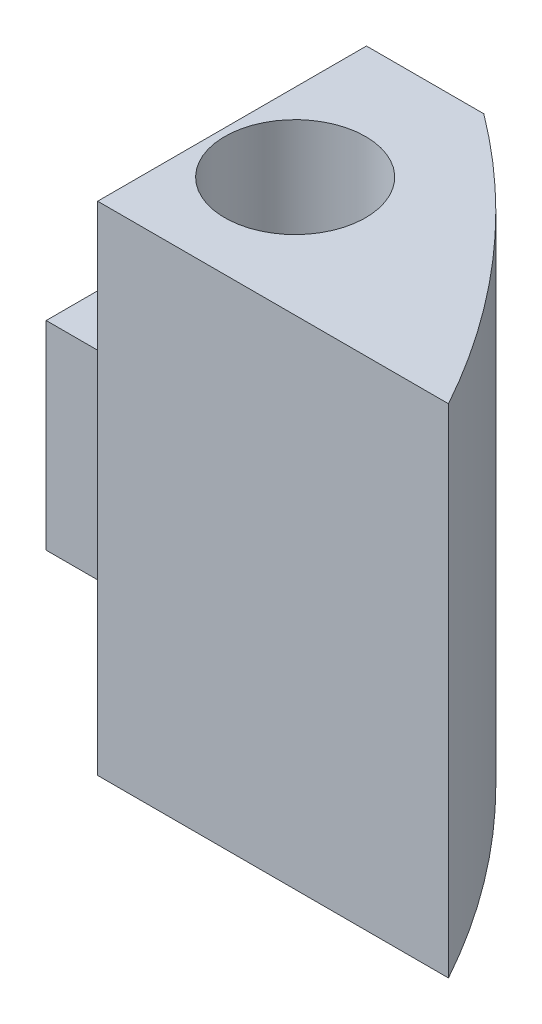
ISO-10303-21;
HEADER;
FILE_DESCRIPTION(('STEP AP214'),'2;1');
FILE_NAME('part.step','',(''),(''),'','','');
FILE_SCHEMA(('AUTOMOTIVE_DESIGN { 1 0 10303 214 1 1 1 1 }'));
ENDSEC;
DATA;
#1=APPLICATION_CONTEXT('core data for automotive mechanical design processes');
#2=APPLICATION_PROTOCOL_DEFINITION('international standard','automotive_design',2000,#1);
#3=PRODUCT_CONTEXT('',#1,'mechanical');
#4=PRODUCT('Part','Part','',(#3));
#5=PRODUCT_RELATED_PRODUCT_CATEGORY('part','',(#4));
#6=PRODUCT_DEFINITION_FORMATION('','',#4);
#7=PRODUCT_DEFINITION_CONTEXT('part definition',#1,'design');
#8=PRODUCT_DEFINITION('design','',#6,#7);
#9=PRODUCT_DEFINITION_SHAPE('','',#8);
#10=(LENGTH_UNIT() NAMED_UNIT(*) SI_UNIT(.MILLI.,.METRE.));
#11=(NAMED_UNIT(*) PLANE_ANGLE_UNIT() SI_UNIT($,.RADIAN.));
#12=(NAMED_UNIT(*) SI_UNIT($,.STERADIAN.) SOLID_ANGLE_UNIT());
#13=UNCERTAINTY_MEASURE_WITH_UNIT(LENGTH_MEASURE(1.E-05),#10,'distance_accuracy_value','');
#14=(GEOMETRIC_REPRESENTATION_CONTEXT(3) GLOBAL_UNCERTAINTY_ASSIGNED_CONTEXT((#13)) GLOBAL_UNIT_ASSIGNED_CONTEXT((#10,
#11,#12)) REPRESENTATION_CONTEXT('',''));
#15=CARTESIAN_POINT('',(0.,0.,0.));
#16=DIRECTION('',(0.,0.,1.));
#17=DIRECTION('',(1.,0.,0.));
#18=AXIS2_PLACEMENT_3D('',#15,#16,#17);
#19=CARTESIAN_POINT('',(12.446,69.6703463550339,-13.0097537928279));
#20=DIRECTION('',(1.,0.,0.));
#21=DIRECTION('',(0.,0.,-1.));
#22=AXIS2_PLACEMENT_3D('',#19,#20,#21);
#23=PLANE('',#22);
#24=DIRECTION('',(0.,-1.,0.));
#25=VECTOR('',#24,1.);
#26=CARTESIAN_POINT('',(12.446,69.6703463550339,-13.0097537928279));
#27=LINE('',#26,#25);
#28=CARTESIAN_POINT('',(12.446,55.5625,-13.0097537928279));
#29=VERTEX_POINT('',#28);
#30=CARTESIAN_POINT('',(12.446,39.6875,-13.0097537928279));
#31=VERTEX_POINT('',#30);
#32=EDGE_CURVE('E133',#29,#31,#27,.T.);
#33=ORIENTED_EDGE('',*,*,#32,.F.);
#34=DIRECTION('',(0.,0.,-1.));
#35=VECTOR('',#34,1.);
#36=CARTESIAN_POINT('',(12.446,55.5625,-13.0097537928279));
#37=LINE('',#36,#35);
#38=CARTESIAN_POINT('',(12.446,55.5625,-21.59));
#39=VERTEX_POINT('',#38);
#40=EDGE_CURVE('E142',#29,#39,#37,.T.);
#41=ORIENTED_EDGE('',*,*,#40,.T.);
#42=DIRECTION('',(0.,-1.,0.));
#43=VECTOR('',#42,1.);
#44=CARTESIAN_POINT('',(12.446,69.6703463550339,-21.59));
#45=LINE('',#44,#43);
#46=CARTESIAN_POINT('',(12.446,39.6875,-21.59));
#47=VERTEX_POINT('',#46);
#48=EDGE_CURVE('E138',#39,#47,#45,.T.);
#49=ORIENTED_EDGE('',*,*,#48,.T.);
#50=DIRECTION('',(0.,0.,1.));
#51=VECTOR('',#50,1.);
#52=CARTESIAN_POINT('',(12.446,39.6875,-13.0097537928279));
#53=LINE('',#52,#51);
#54=EDGE_CURVE('E134',#47,#31,#53,.T.);
#55=ORIENTED_EDGE('',*,*,#54,.T.);
#56=EDGE_LOOP('',(#33,#41,#49,#55));
#57=FACE_BOUND('',#56,.T.);
#58=DIRECTION('',(0.,1.,0.));
#59=VECTOR('',#58,1.);
#60=CARTESIAN_POINT('',(12.446,44.45,-13.6525));
#61=LINE('',#60,#59);
#62=CARTESIAN_POINT('',(12.446,44.45,-13.6525));
#63=VERTEX_POINT('',#62);
#64=CARTESIAN_POINT('',(12.446,50.8,-13.6525));
#65=VERTEX_POINT('',#64);
#66=EDGE_CURVE('E52',#63,#65,#61,.T.);
#67=ORIENTED_EDGE('',*,*,#66,.F.);
#68=DIRECTION('',(0.,0.,1.));
#69=VECTOR('',#68,1.);
#70=CARTESIAN_POINT('',(12.446,44.45,-20.0025));
#71=LINE('',#70,#69);
#72=CARTESIAN_POINT('',(12.446,44.45,-20.0025));
#73=VERTEX_POINT('',#72);
#74=EDGE_CURVE('E57',#73,#63,#71,.T.);
#75=ORIENTED_EDGE('',*,*,#74,.F.);
#76=DIRECTION('',(0.,-1.,0.));
#77=VECTOR('',#76,1.);
#78=CARTESIAN_POINT('',(12.446,50.8,-20.0025));
#79=LINE('',#78,#77);
#80=CARTESIAN_POINT('',(12.446,50.8,-20.0025));
#81=VERTEX_POINT('',#80);
#82=EDGE_CURVE('E99',#81,#73,#79,.T.);
#83=ORIENTED_EDGE('',*,*,#82,.F.);
#84=DIRECTION('',(0.,0.,-1.));
#85=VECTOR('',#84,1.);
#86=CARTESIAN_POINT('',(12.446,50.8,-13.6525));
#87=LINE('',#86,#85);
#88=EDGE_CURVE('E102',#65,#81,#87,.T.);
#89=ORIENTED_EDGE('',*,*,#88,.F.);
#90=EDGE_LOOP('',(#67,#75,#83,#89));
#91=FACE_BOUND('',#90,.T.);
#92=ADVANCED_FACE('F37',(#57,#91),#23,.F.);
#93=CARTESIAN_POINT('',(0.,39.6875,0.));
#94=DIRECTION('',(0.,1.,0.));
#95=DIRECTION('',(0.,0.,1.));
#96=AXIS2_PLACEMENT_3D('',#93,#94,#95);
#97=PLANE('',#96);
#98=CARTESIAN_POINT('',(0.,39.6875,0.));
#99=DIRECTION('',(0.,1.,0.));
#100=DIRECTION('',(0.,0.,1.));
#101=AXIS2_PLACEMENT_3D('',#98,#99,#100);
#102=CIRCLE('',#101,26.9875);
#103=CARTESIAN_POINT('',(23.6446920576268,39.6875,-13.0097537928279));
#104=VERTEX_POINT('',#103);
#105=CARTESIAN_POINT('',(16.1925,39.6875,-21.59));
#106=VERTEX_POINT('',#105);
#107=EDGE_CURVE('E144',#104,#106,#102,.T.);
#108=ORIENTED_EDGE('',*,*,#107,.F.);
#109=DIRECTION('',(1.,0.,0.));
#110=VECTOR('',#109,1.);
#111=CARTESIAN_POINT('',(12.446,39.6875,-13.0097537928279));
#112=LINE('',#111,#110);
#113=EDGE_CURVE('E45',#31,#104,#112,.T.);
#114=ORIENTED_EDGE('',*,*,#113,.F.);
#115=ORIENTED_EDGE('',*,*,#54,.F.);
#116=DIRECTION('',(-1.,0.,0.));
#117=VECTOR('',#116,1.);
#118=CARTESIAN_POINT('',(16.1925,39.6875,-21.59));
#119=LINE('',#118,#117);
#120=EDGE_CURVE('E139',#106,#47,#119,.T.);
#121=ORIENTED_EDGE('',*,*,#120,.F.);
#122=EDGE_LOOP('',(#108,#114,#115,#121));
#123=FACE_BOUND('',#122,.T.);
#124=CARTESIAN_POINT('',(14.9331760640529,39.6875,-16.8275));
#125=DIRECTION('',(0.,1.,0.));
#126=DIRECTION('',(0.,0.,1.));
#127=AXIS2_PLACEMENT_3D('',#124,#125,#126);
#128=CIRCLE('',#127,2.2479);
#129=CARTESIAN_POINT('',(14.9331760640529,39.6875,-19.0754));
#130=VERTEX_POINT('',#129);
#131=EDGE_CURVE('E149',#130,#130,#128,.T.);
#132=ORIENTED_EDGE('',*,*,#131,.T.);
#133=EDGE_LOOP('',(#132));
#134=FACE_BOUND('',#133,.T.);
#135=ADVANCED_FACE('F181',(#123,#134),#97,.F.);
#136=CARTESIAN_POINT('',(0.,69.6703463550339,0.));
#137=DIRECTION('',(0.,-1.,0.));
#138=DIRECTION('',(0.,0.,-1.));
#139=AXIS2_PLACEMENT_3D('',#136,#137,#138);
#140=CYLINDRICAL_SURFACE('',#139,26.9875);
#141=DIRECTION('',(0.,-1.,0.));
#142=VECTOR('',#141,1.);
#143=CARTESIAN_POINT('',(16.1925,69.6703463550339,-21.59));
#144=LINE('',#143,#142);
#145=CARTESIAN_POINT('',(16.1925,55.5625,-21.59));
#146=VERTEX_POINT('',#145);
#147=EDGE_CURVE('E143',#146,#106,#144,.T.);
#148=ORIENTED_EDGE('',*,*,#147,.F.);
#149=CARTESIAN_POINT('',(0.,55.5625,0.));
#150=DIRECTION('',(0.,-1.,0.));
#151=DIRECTION('',(0.,0.,-1.));
#152=AXIS2_PLACEMENT_3D('',#149,#150,#151);
#153=CIRCLE('',#152,26.9875);
#154=CARTESIAN_POINT('',(23.6446920576268,55.5625,-13.0097537928279));
#155=VERTEX_POINT('',#154);
#156=EDGE_CURVE('E152',#146,#155,#153,.T.);
#157=ORIENTED_EDGE('',*,*,#156,.T.);
#158=DIRECTION('',(0.,-1.,0.));
#159=VECTOR('',#158,1.);
#160=CARTESIAN_POINT('',(23.6446920576268,69.6703463550339,-13.0097537928279));
#161=LINE('',#160,#159);
#162=EDGE_CURVE('E148',#155,#104,#161,.T.);
#163=ORIENTED_EDGE('',*,*,#162,.T.);
#164=ORIENTED_EDGE('',*,*,#107,.T.);
#165=EDGE_LOOP('',(#148,#157,#163,#164));
#166=FACE_BOUND('',#165,.T.);
#167=ADVANCED_FACE('F171',(#166),#140,.T.);
#168=CARTESIAN_POINT('',(16.1925,69.6703463550339,-21.59));
#169=DIRECTION('',(0.,0.,1.));
#170=DIRECTION('',(1.,0.,0.));
#171=AXIS2_PLACEMENT_3D('',#168,#169,#170);
#172=PLANE('',#171);
#173=ORIENTED_EDGE('',*,*,#48,.F.);
#174=DIRECTION('',(1.,0.,0.));
#175=VECTOR('',#174,1.);
#176=CARTESIAN_POINT('',(16.1925,55.5625,-21.59));
#177=LINE('',#176,#175);
#178=EDGE_CURVE('E147',#39,#146,#177,.T.);
#179=ORIENTED_EDGE('',*,*,#178,.T.);
#180=ORIENTED_EDGE('',*,*,#147,.T.);
#181=ORIENTED_EDGE('',*,*,#120,.T.);
#182=EDGE_LOOP('',(#173,#179,#180,#181));
#183=FACE_BOUND('',#182,.T.);
#184=ADVANCED_FACE('F176',(#183),#172,.F.);
#185=CARTESIAN_POINT('',(12.446,69.6703463550339,-13.0097537928279));
#186=DIRECTION('',(0.,0.,-1.));
#187=DIRECTION('',(-1.,0.,0.));
#188=AXIS2_PLACEMENT_3D('',#185,#186,#187);
#189=PLANE('',#188);
#190=ORIENTED_EDGE('',*,*,#162,.F.);
#191=DIRECTION('',(-1.,0.,0.));
#192=VECTOR('',#191,1.);
#193=CARTESIAN_POINT('',(12.446,55.5625,-13.0097537928279));
#194=LINE('',#193,#192);
#195=EDGE_CURVE('E137',#155,#29,#194,.T.);
#196=ORIENTED_EDGE('',*,*,#195,.T.);
#197=ORIENTED_EDGE('',*,*,#32,.T.);
#198=ORIENTED_EDGE('',*,*,#113,.T.);
#199=EDGE_LOOP('',(#190,#196,#197,#198));
#200=FACE_BOUND('',#199,.T.);
#201=ADVANCED_FACE('F166',(#200),#189,.F.);
#202=CARTESIAN_POINT('',(14.9331760640529,69.6703463550339,-16.8275));
#203=DIRECTION('',(0.,-1.,0.));
#204=DIRECTION('',(0.,0.,-1.));
#205=AXIS2_PLACEMENT_3D('',#202,#203,#204);
#206=CYLINDRICAL_SURFACE('',#205,2.2479);
#207=CARTESIAN_POINT('',(14.9331760640529,55.5625,-16.8275));
#208=DIRECTION('',(0.,-1.,0.));
#209=DIRECTION('',(0.,0.,-1.));
#210=AXIS2_PLACEMENT_3D('',#207,#208,#209);
#211=CIRCLE('',#210,2.2479);
#212=CARTESIAN_POINT('',(14.9331760640529,55.5625,-19.0754));
#213=VERTEX_POINT('',#212);
#214=EDGE_CURVE('E11',#213,#213,#211,.T.);
#215=CARTESIAN_POINT('',(14.9331760640529,55.5625,-19.0754));
#216=CARTESIAN_POINT('',(14.9331760640529,55.3971354166667,-19.0754));
#217=CARTESIAN_POINT('',(14.9331760640529,55.2317708333333,-19.0754));
#218=CARTESIAN_POINT('',(14.9331760640529,54.9010416666667,-19.0754));
#219=CARTESIAN_POINT('',(14.9331760640529,54.7356770833333,-19.0754));
#220=CARTESIAN_POINT('',(14.9331760640529,54.4049479166667,-19.0754));
#221=CARTESIAN_POINT('',(14.9331760640529,54.2395833333333,-19.0754));
#222=CARTESIAN_POINT('',(14.9331760640529,53.9088541666667,-19.0754));
#223=CARTESIAN_POINT('',(14.9331760640529,53.7434895833333,-19.0754));
#224=CARTESIAN_POINT('',(14.9331760640529,53.4127604166667,-19.0754));
#225=CARTESIAN_POINT('',(14.9331760640529,53.2473958333333,-19.0754));
#226=CARTESIAN_POINT('',(14.9331760640529,52.9166666666667,-19.0754));
#227=CARTESIAN_POINT('',(14.9331760640529,52.7513020833333,-19.0754));
#228=CARTESIAN_POINT('',(14.9331760640529,52.4205729166667,-19.0754));
#229=CARTESIAN_POINT('',(14.9331760640529,52.2552083333333,-19.0754));
#230=CARTESIAN_POINT('',(14.9331760640529,51.9244791666667,-19.0754));
#231=CARTESIAN_POINT('',(14.9331760640529,51.7591145833333,-19.0754));
#232=CARTESIAN_POINT('',(14.9331760640529,51.4283854166667,-19.0754));
#233=CARTESIAN_POINT('',(14.9331760640529,51.2630208333333,-19.0754));
#234=CARTESIAN_POINT('',(14.9331760640529,50.9322916666667,-19.0754));
#235=CARTESIAN_POINT('',(14.9331760640529,50.7669270833333,-19.0754));
#236=CARTESIAN_POINT('',(14.9331760640529,50.4361979166667,-19.0754));
#237=CARTESIAN_POINT('',(14.9331760640529,50.2708333333333,-19.0754));
#238=CARTESIAN_POINT('',(14.9331760640529,49.9401041666667,-19.0754));
#239=CARTESIAN_POINT('',(14.9331760640529,49.7747395833333,-19.0754));
#240=CARTESIAN_POINT('',(14.9331760640529,49.4440104166667,-19.0754));
#241=CARTESIAN_POINT('',(14.9331760640529,49.2786458333333,-19.0754));
#242=CARTESIAN_POINT('',(14.9331760640529,48.9479166666667,-19.0754));
#243=CARTESIAN_POINT('',(14.9331760640529,48.7825520833333,-19.0754));
#244=CARTESIAN_POINT('',(14.9331760640529,48.4518229166667,-19.0754));
#245=CARTESIAN_POINT('',(14.9331760640529,48.2864583333333,-19.0754));
#246=CARTESIAN_POINT('',(14.9331760640529,47.9557291666667,-19.0754));
#247=CARTESIAN_POINT('',(14.9331760640529,47.7903645833333,-19.0754));
#248=CARTESIAN_POINT('',(14.9331760640529,47.4596354166667,-19.0754));
#249=CARTESIAN_POINT('',(14.9331760640529,47.2942708333333,-19.0754));
#250=CARTESIAN_POINT('',(14.9331760640529,46.9635416666667,-19.0754));
#251=CARTESIAN_POINT('',(14.9331760640529,46.7981770833333,-19.0754));
#252=CARTESIAN_POINT('',(14.9331760640529,46.4674479166667,-19.0754));
#253=CARTESIAN_POINT('',(14.9331760640529,46.3020833333333,-19.0754));
#254=CARTESIAN_POINT('',(14.9331760640529,45.9713541666667,-19.0754));
#255=CARTESIAN_POINT('',(14.9331760640529,45.8059895833333,-19.0754));
#256=CARTESIAN_POINT('',(14.9331760640529,45.4752604166667,-19.0754));
#257=CARTESIAN_POINT('',(14.9331760640529,45.3098958333333,-19.0754));
#258=CARTESIAN_POINT('',(14.9331760640529,44.9791666666667,-19.0754));
#259=CARTESIAN_POINT('',(14.9331760640529,44.8138020833333,-19.0754));
#260=CARTESIAN_POINT('',(14.9331760640529,44.4830729166667,-19.0754));
#261=CARTESIAN_POINT('',(14.9331760640529,44.3177083333333,-19.0754));
#262=CARTESIAN_POINT('',(14.9331760640529,43.9869791666667,-19.0754));
#263=CARTESIAN_POINT('',(14.9331760640529,43.8216145833333,-19.0754));
#264=CARTESIAN_POINT('',(14.9331760640529,43.4908854166667,-19.0754));
#265=CARTESIAN_POINT('',(14.9331760640529,43.3255208333333,-19.0754));
#266=CARTESIAN_POINT('',(14.9331760640529,42.9947916666667,-19.0754));
#267=CARTESIAN_POINT('',(14.9331760640529,42.8294270833333,-19.0754));
#268=CARTESIAN_POINT('',(14.9331760640529,42.4986979166667,-19.0754));
#269=CARTESIAN_POINT('',(14.9331760640529,42.3333333333333,-19.0754));
#270=CARTESIAN_POINT('',(14.9331760640529,42.0026041666667,-19.0754));
#271=CARTESIAN_POINT('',(14.9331760640529,41.8372395833333,-19.0754));
#272=CARTESIAN_POINT('',(14.9331760640529,41.5065104166667,-19.0754));
#273=CARTESIAN_POINT('',(14.9331760640529,41.3411458333333,-19.0754));
#274=CARTESIAN_POINT('',(14.9331760640529,41.0104166666667,-19.0754));
#275=CARTESIAN_POINT('',(14.9331760640529,40.8450520833333,-19.0754));
#276=CARTESIAN_POINT('',(14.9331760640529,40.5143229166667,-19.0754));
#277=CARTESIAN_POINT('',(14.9331760640529,40.3489583333333,-19.0754));
#278=CARTESIAN_POINT('',(14.9331760640529,40.0182291666667,-19.0754));
#279=CARTESIAN_POINT('',(14.9331760640529,39.8528645833333,-19.0754));
#280=CARTESIAN_POINT('',(14.9331760640529,39.6875,-19.0754));
#281=B_SPLINE_CURVE_WITH_KNOTS('',3,(#215,#216,#217,#218,#219,#220,#221,#222,#223,#224,#225,
#226,#227,#228,#229,#230,#231,#232,#233,#234,#235,#236,#237,#238,#239,#240,#241,#242,#243,#244,
#245,#246,#247,#248,#249,#250,#251,#252,#253,#254,#255,#256,#257,#258,#259,#260,#261,#262,#263,
#264,#265,#266,#267,#268,#269,#270,#271,#272,#273,#274,#275,#276,#277,#278,#279,#280),
.UNSPECIFIED.,.F.,.F.,(4,2,2,2,2,2,2,2,2,2,2,2,2,2,2,2,2,2,2,2,2,2,2,2,2,2,2,2,2,2,2,2,4),(0.,
0.496093750000003,0.992187499999998,1.48828125,1.984375,2.48046875,2.9765625,3.47265625,3.96875,
4.46484375,4.96093750000001,5.45703125,5.953125,6.44921875000001,6.9453125,7.44140625,
7.93750000000001,8.43359375,8.92968750000001,9.42578125000001,9.921875,10.41796875,10.9140625,
11.41015625,11.90625,12.40234375,12.8984375,13.39453125,13.890625,14.38671875,14.8828125,
15.37890625,15.875),.UNSPECIFIED.);
#282=EDGE_CURVE('BSEAM187',#213,#130,#281,.T.);
#283=ORIENTED_EDGE('',*,*,#214,.F.);
#284=ORIENTED_EDGE('',*,*,#131,.F.);
#285=ORIENTED_EDGE('',*,*,#282,.T.);
#286=ORIENTED_EDGE('',*,*,#282,.F.);
#287=EDGE_LOOP('',(#283,#285,#284,#286));
#288=FACE_BOUND('',#287,.T.);
#289=ADVANCED_FACE('F187',(#288),#206,.F.);
#290=CARTESIAN_POINT('',(34.780382401578,55.5625,21.59));
#291=DIRECTION('',(0.,-1.,0.));
#292=DIRECTION('',(0.,0.,-1.));
#293=AXIS2_PLACEMENT_3D('',#290,#291,#292);
#294=PLANE('',#293);
#295=ORIENTED_EDGE('',*,*,#214,.T.);
#296=EDGE_LOOP('',(#295));
#297=FACE_BOUND('',#296,.T.);
#298=ORIENTED_EDGE('',*,*,#178,.F.);
#299=ORIENTED_EDGE('',*,*,#40,.F.);
#300=ORIENTED_EDGE('',*,*,#195,.F.);
#301=ORIENTED_EDGE('',*,*,#156,.F.);
#302=EDGE_LOOP('',(#298,#299,#300,#301));
#303=FACE_BOUND('',#302,.T.);
#304=ADVANCED_FACE('F39',(#297,#303),#294,.F.);
#305=CARTESIAN_POINT('',(1.17974387893085,44.45,-20.0025));
#306=DIRECTION('',(0.,1.,0.));
#307=DIRECTION('',(0.,0.,1.));
#308=AXIS2_PLACEMENT_3D('',#305,#306,#307);
#309=PLANE('',#308);
#310=DIRECTION('',(1.,0.,0.));
#311=VECTOR('',#310,1.);
#312=CARTESIAN_POINT('',(1.17974387893085,44.45,-13.6525));
#313=LINE('',#312,#311);
#314=CARTESIAN_POINT('',(10.16,44.45,-13.6525));
#315=VERTEX_POINT('',#314);
#316=EDGE_CURVE('E124',#315,#63,#313,.T.);
#317=ORIENTED_EDGE('',*,*,#316,.F.);
#318=DIRECTION('',(0.,0.,-1.));
#319=VECTOR('',#318,1.);
#320=CARTESIAN_POINT('',(10.16,44.45,-20.0025));
#321=LINE('',#320,#319);
#322=CARTESIAN_POINT('',(10.16,44.45,-20.0025));
#323=VERTEX_POINT('',#322);
#324=EDGE_CURVE('E128',#315,#323,#321,.T.);
#325=ORIENTED_EDGE('',*,*,#324,.T.);
#326=DIRECTION('',(1.,0.,0.));
#327=VECTOR('',#326,1.);
#328=CARTESIAN_POINT('',(1.17974387893085,44.45,-20.0025));
#329=LINE('',#328,#327);
#330=EDGE_CURVE('E115',#323,#73,#329,.T.);
#331=ORIENTED_EDGE('',*,*,#330,.T.);
#332=ORIENTED_EDGE('',*,*,#74,.T.);
#333=EDGE_LOOP('',(#317,#325,#331,#332));
#334=FACE_BOUND('',#333,.T.);
#335=ADVANCED_FACE('F194',(#334),#309,.F.);
#336=CARTESIAN_POINT('',(1.17974387893085,50.8,-20.0025));
#337=DIRECTION('',(0.,0.,1.));
#338=DIRECTION('',(0.,-1.,0.));
#339=AXIS2_PLACEMENT_3D('',#336,#337,#338);
#340=PLANE('',#339);
#341=ORIENTED_EDGE('',*,*,#330,.F.);
#342=DIRECTION('',(0.,1.,0.));
#343=VECTOR('',#342,1.);
#344=CARTESIAN_POINT('',(10.16,50.8,-20.0025));
#345=LINE('',#344,#343);
#346=CARTESIAN_POINT('',(10.16,50.8,-20.0025));
#347=VERTEX_POINT('',#346);
#348=EDGE_CURVE('E111',#323,#347,#345,.T.);
#349=ORIENTED_EDGE('',*,*,#348,.T.);
#350=DIRECTION('',(1.,0.,0.));
#351=VECTOR('',#350,1.);
#352=CARTESIAN_POINT('',(1.17974387893085,50.8,-20.0025));
#353=LINE('',#352,#351);
#354=EDGE_CURVE('E109',#347,#81,#353,.T.);
#355=ORIENTED_EDGE('',*,*,#354,.T.);
#356=ORIENTED_EDGE('',*,*,#82,.T.);
#357=EDGE_LOOP('',(#341,#349,#355,#356));
#358=FACE_BOUND('',#357,.T.);
#359=ADVANCED_FACE('F110',(#358),#340,.F.);
#360=CARTESIAN_POINT('',(1.17974387893085,50.8,-13.6525));
#361=DIRECTION('',(0.,-1.,0.));
#362=DIRECTION('',(0.,0.,-1.));
#363=AXIS2_PLACEMENT_3D('',#360,#361,#362);
#364=PLANE('',#363);
#365=ORIENTED_EDGE('',*,*,#354,.F.);
#366=DIRECTION('',(0.,0.,1.));
#367=VECTOR('',#366,1.);
#368=CARTESIAN_POINT('',(10.16,50.8,-13.6525));
#369=LINE('',#368,#367);
#370=CARTESIAN_POINT('',(10.16,50.8,-13.6525));
#371=VERTEX_POINT('',#370);
#372=EDGE_CURVE('E281',#347,#371,#369,.T.);
#373=ORIENTED_EDGE('',*,*,#372,.T.);
#374=DIRECTION('',(1.,0.,0.));
#375=VECTOR('',#374,1.);
#376=CARTESIAN_POINT('',(1.17974387893085,50.8,-13.6525));
#377=LINE('',#376,#375);
#378=EDGE_CURVE('E114',#371,#65,#377,.T.);
#379=ORIENTED_EDGE('',*,*,#378,.T.);
#380=ORIENTED_EDGE('',*,*,#88,.T.);
#381=EDGE_LOOP('',(#365,#373,#379,#380));
#382=FACE_BOUND('',#381,.T.);
#383=ADVANCED_FACE('F117',(#382),#364,.F.);
#384=CARTESIAN_POINT('',(1.17974387893085,44.45,-13.6525));
#385=DIRECTION('',(0.,0.,-1.));
#386=DIRECTION('',(0.,1.,0.));
#387=AXIS2_PLACEMENT_3D('',#384,#385,#386);
#388=PLANE('',#387);
#389=ORIENTED_EDGE('',*,*,#378,.F.);
#390=DIRECTION('',(0.,-1.,0.));
#391=VECTOR('',#390,1.);
#392=CARTESIAN_POINT('',(10.16,44.45,-13.6525));
#393=LINE('',#392,#391);
#394=EDGE_CURVE('E153',#371,#315,#393,.T.);
#395=ORIENTED_EDGE('',*,*,#394,.T.);
#396=ORIENTED_EDGE('',*,*,#316,.T.);
#397=ORIENTED_EDGE('',*,*,#66,.T.);
#398=EDGE_LOOP('',(#389,#395,#396,#397));
#399=FACE_BOUND('',#398,.T.);
#400=ADVANCED_FACE('F259',(#399),#388,.F.);
#401=CARTESIAN_POINT('',(10.16,47.625,0.));
#402=DIRECTION('',(1.,0.,0.));
#403=DIRECTION('',(0.,0.,-1.));
#404=AXIS2_PLACEMENT_3D('',#401,#402,#403);
#405=PLANE('',#404);
#406=ORIENTED_EDGE('',*,*,#372,.F.);
#407=ORIENTED_EDGE('',*,*,#348,.F.);
#408=ORIENTED_EDGE('',*,*,#324,.F.);
#409=ORIENTED_EDGE('',*,*,#394,.F.);
#410=EDGE_LOOP('',(#406,#407,#408,#409));
#411=FACE_BOUND('',#410,.T.);
#412=ADVANCED_FACE('F268',(#411),#405,.F.);
#413=CLOSED_SHELL('',(#92,#135,#167,#184,#201,#289,#304,#335,#359,#383,#400,#412));
#414=MANIFOLD_SOLID_BREP('B2',#413);
#415=ADVANCED_BREP_SHAPE_REPRESENTATION('',(#18,#414),#14);
#416=SHAPE_DEFINITION_REPRESENTATION(#9,#415);
ENDSEC;
END-ISO-10303-21;
